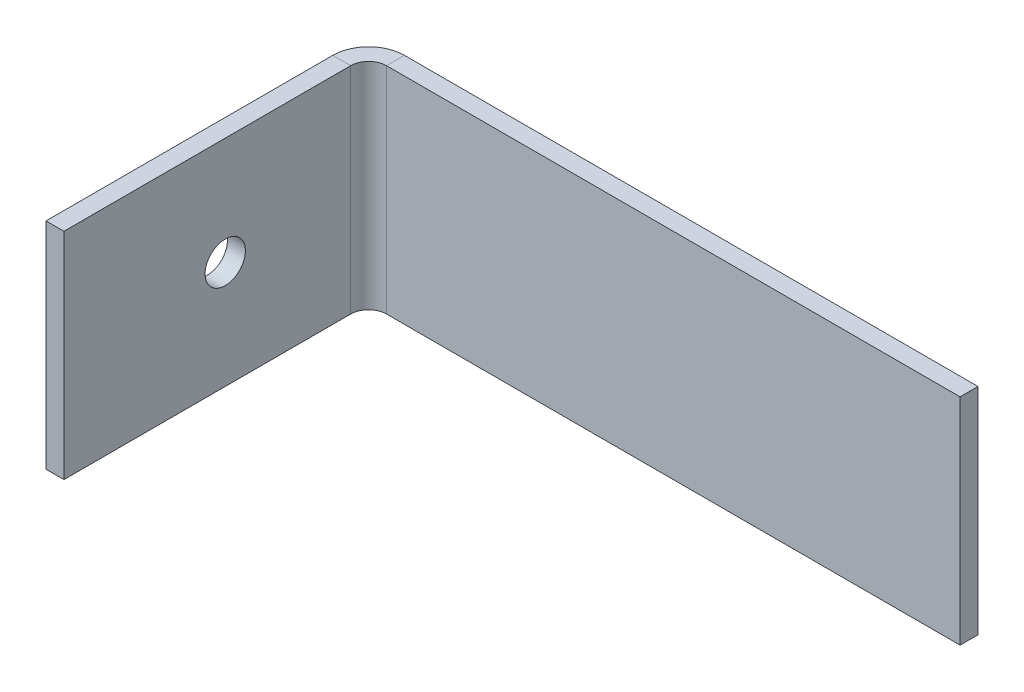
ISO-10303-21;
HEADER;
FILE_DESCRIPTION(('STEP AP214'),'2;1');
FILE_NAME('part.step','',(''),(''),'','','');
FILE_SCHEMA(('AUTOMOTIVE_DESIGN { 1 0 10303 214 1 1 1 1 }'));
ENDSEC;
DATA;
#1=APPLICATION_CONTEXT('core data for automotive mechanical design processes');
#2=APPLICATION_PROTOCOL_DEFINITION('international standard','automotive_design',2000,#1);
#3=PRODUCT_CONTEXT('',#1,'mechanical');
#4=PRODUCT('Part','Part','',(#3));
#5=PRODUCT_RELATED_PRODUCT_CATEGORY('part','',(#4));
#6=PRODUCT_DEFINITION_FORMATION('','',#4);
#7=PRODUCT_DEFINITION_CONTEXT('part definition',#1,'design');
#8=PRODUCT_DEFINITION('design','',#6,#7);
#9=PRODUCT_DEFINITION_SHAPE('','',#8);
#10=(LENGTH_UNIT() NAMED_UNIT(*) SI_UNIT(.MILLI.,.METRE.));
#11=(NAMED_UNIT(*) PLANE_ANGLE_UNIT() SI_UNIT($,.RADIAN.));
#12=(NAMED_UNIT(*) SI_UNIT($,.STERADIAN.) SOLID_ANGLE_UNIT());
#13=UNCERTAINTY_MEASURE_WITH_UNIT(LENGTH_MEASURE(1.E-05),#10,'distance_accuracy_value','');
#14=(GEOMETRIC_REPRESENTATION_CONTEXT(3) GLOBAL_UNCERTAINTY_ASSIGNED_CONTEXT((#13)) GLOBAL_UNIT_ASSIGNED_CONTEXT((#10,
#11,#12)) REPRESENTATION_CONTEXT('',''));
#15=CARTESIAN_POINT('',(0.,0.,0.));
#16=DIRECTION('',(0.,0.,1.));
#17=DIRECTION('',(1.,0.,0.));
#18=AXIS2_PLACEMENT_3D('',#15,#16,#17);
#19=CARTESIAN_POINT('',(107.95,-38.1,-6.35));
#20=DIRECTION('',(0.,-1.,0.));
#21=DIRECTION('',(1.,0.,0.));
#22=AXIS2_PLACEMENT_3D('',#19,#20,#21);
#23=PLANE('',#22);
#24=DIRECTION('',(1.,0.,0.));
#25=VECTOR('',#24,1.);
#26=CARTESIAN_POINT('',(107.95,-38.1,0.));
#27=LINE('',#26,#25);
#28=CARTESIAN_POINT('',(-95.25,-38.1,0.));
#29=VERTEX_POINT('',#28);
#30=CARTESIAN_POINT('',(107.95,-38.1,0.));
#31=VERTEX_POINT('',#30);
#32=EDGE_CURVE('E101',#29,#31,#27,.T.);
#33=ORIENTED_EDGE('',*,*,#32,.F.);
#34=DIRECTION('',(0.,0.,-1.));
#35=VECTOR('',#34,1.);
#36=CARTESIAN_POINT('',(-95.25,-38.1,0.));
#37=LINE('',#36,#35);
#38=CARTESIAN_POINT('',(-95.25,-38.1,-6.34999999999999));
#39=VERTEX_POINT('',#38);
#40=EDGE_CURVE('E116',#29,#39,#37,.T.);
#41=ORIENTED_EDGE('',*,*,#40,.T.);
#42=DIRECTION('',(1.,0.,0.));
#43=VECTOR('',#42,1.);
#44=CARTESIAN_POINT('',(107.95,-38.1,-6.35));
#45=LINE('',#44,#43);
#46=CARTESIAN_POINT('',(107.95,-38.1,-6.35));
#47=VERTEX_POINT('',#46);
#48=EDGE_CURVE('E108',#39,#47,#45,.T.);
#49=ORIENTED_EDGE('',*,*,#48,.T.);
#50=DIRECTION('',(0.,0.,1.));
#51=VECTOR('',#50,1.);
#52=CARTESIAN_POINT('',(107.95,-38.1,-6.35));
#53=LINE('',#52,#51);
#54=EDGE_CURVE('E62',#47,#31,#53,.T.);
#55=ORIENTED_EDGE('',*,*,#54,.T.);
#56=EDGE_LOOP('',(#33,#41,#49,#55));
#57=FACE_BOUND('',#56,.T.);
#58=ADVANCED_FACE('F59',(#57),#23,.T.);
#59=CARTESIAN_POINT('',(0.,0.,-6.35));
#60=DIRECTION('',(0.,0.,1.));
#61=DIRECTION('',(1.,0.,0.));
#62=AXIS2_PLACEMENT_3D('',#59,#60,#61);
#63=PLANE('',#62);
#64=DIRECTION('',(0.,-1.,0.));
#65=VECTOR('',#64,1.);
#66=CARTESIAN_POINT('',(-95.25,-38.1,-6.34999999999999));
#67=LINE('',#66,#65);
#68=CARTESIAN_POINT('',(-95.25,38.1,-6.35));
#69=VERTEX_POINT('',#68);
#70=EDGE_CURVE('E132',#39,#69,#67,.F.);
#71=ORIENTED_EDGE('',*,*,#70,.T.);
#72=DIRECTION('',(-1.,0.,0.));
#73=VECTOR('',#72,1.);
#74=CARTESIAN_POINT('',(107.95,38.1,-6.35));
#75=LINE('',#74,#73);
#76=CARTESIAN_POINT('',(107.95,38.1,-6.35));
#77=VERTEX_POINT('',#76);
#78=EDGE_CURVE('E113',#77,#69,#75,.T.);
#79=ORIENTED_EDGE('',*,*,#78,.F.);
#80=DIRECTION('',(0.,1.,0.));
#81=VECTOR('',#80,1.);
#82=CARTESIAN_POINT('',(107.95,-38.1,-6.35));
#83=LINE('',#82,#81);
#84=EDGE_CURVE('E96',#47,#77,#83,.T.);
#85=ORIENTED_EDGE('',*,*,#84,.F.);
#86=ORIENTED_EDGE('',*,*,#48,.F.);
#87=EDGE_LOOP('',(#71,#79,#85,#86));
#88=FACE_BOUND('',#87,.T.);
#89=ADVANCED_FACE('F227',(#88),#63,.F.);
#90=CARTESIAN_POINT('',(0.,0.,0.));
#91=DIRECTION('',(0.,0.,1.));
#92=DIRECTION('',(1.,0.,0.));
#93=AXIS2_PLACEMENT_3D('',#90,#91,#92);
#94=PLANE('',#93);
#95=DIRECTION('',(-1.,0.,0.));
#96=VECTOR('',#95,1.);
#97=CARTESIAN_POINT('',(107.95,38.1,0.));
#98=LINE('',#97,#96);
#99=CARTESIAN_POINT('',(107.95,38.1,0.));
#100=VERTEX_POINT('',#99);
#101=CARTESIAN_POINT('',(-95.25,38.1,0.));
#102=VERTEX_POINT('',#101);
#103=EDGE_CURVE('E100',#100,#102,#98,.T.);
#104=ORIENTED_EDGE('',*,*,#103,.T.);
#105=DIRECTION('',(0.,-1.,0.));
#106=VECTOR('',#105,1.);
#107=CARTESIAN_POINT('',(-95.25,-38.1,0.));
#108=LINE('',#107,#106);
#109=EDGE_CURVE('E73',#29,#102,#108,.F.);
#110=ORIENTED_EDGE('',*,*,#109,.F.);
#111=ORIENTED_EDGE('',*,*,#32,.T.);
#112=DIRECTION('',(0.,1.,0.));
#113=VECTOR('',#112,1.);
#114=CARTESIAN_POINT('',(107.95,-38.1,0.));
#115=LINE('',#114,#113);
#116=EDGE_CURVE('E94',#31,#100,#115,.T.);
#117=ORIENTED_EDGE('',*,*,#116,.T.);
#118=EDGE_LOOP('',(#104,#110,#111,#117));
#119=FACE_BOUND('',#118,.T.);
#120=ADVANCED_FACE('F98',(#119),#94,.T.);
#121=CARTESIAN_POINT('',(107.95,38.1,-6.35));
#122=DIRECTION('',(0.,1.,0.));
#123=DIRECTION('',(-1.,0.,0.));
#124=AXIS2_PLACEMENT_3D('',#121,#122,#123);
#125=PLANE('',#124);
#126=DIRECTION('',(0.,0.,-1.));
#127=VECTOR('',#126,1.);
#128=CARTESIAN_POINT('',(-95.25,38.1,0.));
#129=LINE('',#128,#127);
#130=EDGE_CURVE('E107',#102,#69,#129,.T.);
#131=ORIENTED_EDGE('',*,*,#130,.F.);
#132=ORIENTED_EDGE('',*,*,#103,.F.);
#133=DIRECTION('',(0.,0.,1.));
#134=VECTOR('',#133,1.);
#135=CARTESIAN_POINT('',(107.95,38.1,-6.35));
#136=LINE('',#135,#134);
#137=EDGE_CURVE('E13',#77,#100,#136,.T.);
#138=ORIENTED_EDGE('',*,*,#137,.F.);
#139=ORIENTED_EDGE('',*,*,#78,.T.);
#140=EDGE_LOOP('',(#131,#132,#138,#139));
#141=FACE_BOUND('',#140,.T.);
#142=ADVANCED_FACE('F105',(#141),#125,.T.);
#143=CARTESIAN_POINT('',(107.95,-38.1,-6.35));
#144=DIRECTION('',(1.,0.,0.));
#145=DIRECTION('',(0.,0.,-1.));
#146=AXIS2_PLACEMENT_3D('',#143,#144,#145);
#147=PLANE('',#146);
#148=ORIENTED_EDGE('',*,*,#116,.F.);
#149=ORIENTED_EDGE('',*,*,#54,.F.);
#150=ORIENTED_EDGE('',*,*,#84,.T.);
#151=ORIENTED_EDGE('',*,*,#137,.T.);
#152=EDGE_LOOP('',(#148,#149,#150,#151));
#153=FACE_BOUND('',#152,.T.);
#154=ADVANCED_FACE('F92',(#153),#147,.T.);
#155=CARTESIAN_POINT('',(-95.25,38.1,6.35));
#156=DIRECTION('',(0.,1.,0.));
#157=DIRECTION('',(0.,0.,1.));
#158=AXIS2_PLACEMENT_3D('',#155,#156,#157);
#159=PLANE('',#158);
#160=DIRECTION('',(1.,0.,0.));
#161=VECTOR('',#160,1.);
#162=CARTESIAN_POINT('',(-107.95,38.1,6.34999999999996));
#163=LINE('',#162,#161);
#164=CARTESIAN_POINT('',(-101.6,38.1,6.34999999999998));
#165=VERTEX_POINT('',#164);
#166=CARTESIAN_POINT('',(-107.95,38.1,6.34999999999996));
#167=VERTEX_POINT('',#166);
#168=EDGE_CURVE('E137',#165,#167,#163,.F.);
#169=ORIENTED_EDGE('',*,*,#168,.F.);
#170=CARTESIAN_POINT('',(-95.25,38.1,6.35));
#171=DIRECTION('',(0.,-1.,0.));
#172=DIRECTION('',(0.,0.,-1.));
#173=AXIS2_PLACEMENT_3D('',#170,#171,#172);
#174=CIRCLE('',#173,6.34999999999999);
#175=EDGE_CURVE('E126',#102,#165,#174,.F.);
#176=ORIENTED_EDGE('',*,*,#175,.F.);
#177=ORIENTED_EDGE('',*,*,#130,.T.);
#178=CARTESIAN_POINT('',(-95.25,38.1,6.35));
#179=DIRECTION('',(0.,-1.,0.));
#180=DIRECTION('',(0.,0.,-1.));
#181=AXIS2_PLACEMENT_3D('',#178,#179,#180);
#182=CIRCLE('',#181,12.7);
#183=EDGE_CURVE('E119',#69,#167,#182,.F.);
#184=ORIENTED_EDGE('',*,*,#183,.T.);
#185=EDGE_LOOP('',(#169,#176,#177,#184));
#186=FACE_BOUND('',#185,.T.);
#187=ADVANCED_FACE('F232',(#186),#159,.T.);
#188=CARTESIAN_POINT('',(-95.25,-38.1,6.35));
#189=DIRECTION('',(0.,1.,0.));
#190=DIRECTION('',(0.,0.,1.));
#191=AXIS2_PLACEMENT_3D('',#188,#189,#190);
#192=PLANE('',#191);
#193=CARTESIAN_POINT('',(-95.25,-38.1,6.35));
#194=DIRECTION('',(0.,-1.,0.));
#195=DIRECTION('',(0.,0.,-1.));
#196=AXIS2_PLACEMENT_3D('',#193,#194,#195);
#197=CIRCLE('',#196,6.34999999999999);
#198=CARTESIAN_POINT('',(-101.6,-38.1,6.34999999999998));
#199=VERTEX_POINT('',#198);
#200=EDGE_CURVE('E121',#199,#29,#197,.T.);
#201=ORIENTED_EDGE('',*,*,#200,.F.);
#202=DIRECTION('',(1.,0.,0.));
#203=VECTOR('',#202,1.);
#204=CARTESIAN_POINT('',(-101.6,-38.1,6.34999999999998));
#205=LINE('',#204,#203);
#206=CARTESIAN_POINT('',(-107.95,-38.1,6.34999999999996));
#207=VERTEX_POINT('',#206);
#208=EDGE_CURVE('E144',#199,#207,#205,.F.);
#209=ORIENTED_EDGE('',*,*,#208,.T.);
#210=CARTESIAN_POINT('',(-95.25,-38.1,6.35));
#211=DIRECTION('',(0.,-1.,0.));
#212=DIRECTION('',(0.,0.,-1.));
#213=AXIS2_PLACEMENT_3D('',#210,#211,#212);
#214=CIRCLE('',#213,12.7);
#215=EDGE_CURVE('E129',#207,#39,#214,.T.);
#216=ORIENTED_EDGE('',*,*,#215,.T.);
#217=ORIENTED_EDGE('',*,*,#40,.F.);
#218=EDGE_LOOP('',(#201,#209,#216,#217));
#219=FACE_BOUND('',#218,.T.);
#220=ADVANCED_FACE('F237',(#219),#192,.F.);
#221=CARTESIAN_POINT('',(-95.25,-38.1,6.35));
#222=DIRECTION('',(0.,-1.,0.));
#223=DIRECTION('',(-1.,0.,0.));
#224=AXIS2_PLACEMENT_3D('',#221,#222,#223);
#225=CYLINDRICAL_SURFACE('',#224,12.7);
#226=ORIENTED_EDGE('',*,*,#70,.F.);
#227=ORIENTED_EDGE('',*,*,#215,.F.);
#228=DIRECTION('',(0.,-1.,0.));
#229=VECTOR('',#228,1.);
#230=CARTESIAN_POINT('',(-107.95,38.1,6.34999999999996));
#231=LINE('',#230,#229);
#232=EDGE_CURVE('E147',#207,#167,#231,.F.);
#233=ORIENTED_EDGE('',*,*,#232,.T.);
#234=ORIENTED_EDGE('',*,*,#183,.F.);
#235=EDGE_LOOP('',(#226,#227,#233,#234));
#236=FACE_BOUND('',#235,.T.);
#237=ADVANCED_FACE('F233',(#236),#225,.T.);
#238=CARTESIAN_POINT('',(-95.25,-38.1,6.35));
#239=DIRECTION('',(0.,-1.,0.));
#240=DIRECTION('',(-1.,0.,0.));
#241=AXIS2_PLACEMENT_3D('',#238,#239,#240);
#242=CYLINDRICAL_SURFACE('',#241,6.34999999999999);
#243=ORIENTED_EDGE('',*,*,#109,.T.);
#244=ORIENTED_EDGE('',*,*,#175,.T.);
#245=DIRECTION('',(0.,-1.,0.));
#246=VECTOR('',#245,1.);
#247=CARTESIAN_POINT('',(-101.6,38.1,6.34999999999998));
#248=LINE('',#247,#246);
#249=EDGE_CURVE('E140',#165,#199,#248,.T.);
#250=ORIENTED_EDGE('',*,*,#249,.T.);
#251=ORIENTED_EDGE('',*,*,#200,.T.);
#252=EDGE_LOOP('',(#243,#244,#250,#251));
#253=FACE_BOUND('',#252,.T.);
#254=ADVANCED_FACE('F239',(#253),#242,.F.);
#255=CARTESIAN_POINT('',(-107.95,38.1,0.));
#256=DIRECTION('',(0.,-1.,0.));
#257=DIRECTION('',(0.,0.,-1.));
#258=AXIS2_PLACEMENT_3D('',#255,#256,#257);
#259=PLANE('',#258);
#260=ORIENTED_EDGE('',*,*,#168,.T.);
#261=DIRECTION('',(0.,0.,-1.));
#262=VECTOR('',#261,1.);
#263=CARTESIAN_POINT('',(-107.95,38.1,-3.96871177312644E-13));
#264=LINE('',#263,#262);
#265=CARTESIAN_POINT('',(-107.95,38.1,107.95));
#266=VERTEX_POINT('',#265);
#267=EDGE_CURVE('E159',#266,#167,#264,.T.);
#268=ORIENTED_EDGE('',*,*,#267,.F.);
#269=DIRECTION('',(1.,0.,0.));
#270=VECTOR('',#269,1.);
#271=CARTESIAN_POINT('',(-107.95,38.1,107.95));
#272=LINE('',#271,#270);
#273=CARTESIAN_POINT('',(-101.6,38.1,107.95));
#274=VERTEX_POINT('',#273);
#275=EDGE_CURVE('E168',#266,#274,#272,.T.);
#276=ORIENTED_EDGE('',*,*,#275,.T.);
#277=DIRECTION('',(0.,0.,1.));
#278=VECTOR('',#277,1.);
#279=CARTESIAN_POINT('',(-101.6,38.1,0.));
#280=LINE('',#279,#278);
#281=EDGE_CURVE('E150',#274,#165,#280,.F.);
#282=ORIENTED_EDGE('',*,*,#281,.T.);
#283=EDGE_LOOP('',(#260,#268,#276,#282));
#284=FACE_BOUND('',#283,.T.);
#285=ADVANCED_FACE('F241',(#284),#259,.F.);
#286=CARTESIAN_POINT('',(-107.95,-38.1,107.95));
#287=DIRECTION('',(0.,1.,0.));
#288=DIRECTION('',(0.,0.,1.));
#289=AXIS2_PLACEMENT_3D('',#286,#287,#288);
#290=PLANE('',#289);
#291=ORIENTED_EDGE('',*,*,#208,.F.);
#292=DIRECTION('',(0.,0.,-1.));
#293=VECTOR('',#292,1.);
#294=CARTESIAN_POINT('',(-101.6,-38.1,107.95));
#295=LINE('',#294,#293);
#296=CARTESIAN_POINT('',(-101.6,-38.1,107.95));
#297=VERTEX_POINT('',#296);
#298=EDGE_CURVE('E153',#199,#297,#295,.F.);
#299=ORIENTED_EDGE('',*,*,#298,.T.);
#300=DIRECTION('',(1.,0.,0.));
#301=VECTOR('',#300,1.);
#302=CARTESIAN_POINT('',(-107.95,-38.1,107.95));
#303=LINE('',#302,#301);
#304=CARTESIAN_POINT('',(-107.95,-38.1,107.95));
#305=VERTEX_POINT('',#304);
#306=EDGE_CURVE('E124',#305,#297,#303,.T.);
#307=ORIENTED_EDGE('',*,*,#306,.F.);
#308=DIRECTION('',(0.,0.,1.));
#309=VECTOR('',#308,1.);
#310=CARTESIAN_POINT('',(-107.95,-38.1,-3.96871177312644E-13));
#311=LINE('',#310,#309);
#312=EDGE_CURVE('E162',#207,#305,#311,.T.);
#313=ORIENTED_EDGE('',*,*,#312,.F.);
#314=EDGE_LOOP('',(#291,#299,#307,#313));
#315=FACE_BOUND('',#314,.T.);
#316=ADVANCED_FACE('F200',(#315),#290,.F.);
#317=CARTESIAN_POINT('',(-107.95,0.,-3.96871177312644E-13));
#318=DIRECTION('',(1.,0.,0.));
#319=DIRECTION('',(0.,0.,-1.));
#320=AXIS2_PLACEMENT_3D('',#317,#318,#319);
#321=PLANE('',#320);
#322=CARTESIAN_POINT('',(-107.95,0.,50.8));
#323=DIRECTION('',(1.,0.,0.));
#324=DIRECTION('',(0.,0.,-1.));
#325=AXIS2_PLACEMENT_3D('',#322,#323,#324);
#326=CIRCLE('',#325,7.14375);
#327=CARTESIAN_POINT('',(-107.95,0.,43.65625));
#328=VERTEX_POINT('',#327);
#329=EDGE_CURVE('E141',#328,#328,#326,.F.);
#330=ORIENTED_EDGE('',*,*,#329,.F.);
#331=EDGE_LOOP('',(#330));
#332=FACE_BOUND('',#331,.T.);
#333=ORIENTED_EDGE('',*,*,#232,.F.);
#334=ORIENTED_EDGE('',*,*,#312,.T.);
#335=DIRECTION('',(0.,1.,0.));
#336=VECTOR('',#335,1.);
#337=CARTESIAN_POINT('',(-107.95,0.,107.95));
#338=LINE('',#337,#336);
#339=EDGE_CURVE('E165',#305,#266,#338,.T.);
#340=ORIENTED_EDGE('',*,*,#339,.T.);
#341=ORIENTED_EDGE('',*,*,#267,.T.);
#342=EDGE_LOOP('',(#333,#334,#340,#341));
#343=FACE_BOUND('',#342,.T.);
#344=ADVANCED_FACE('F186',(#332,#343),#321,.F.);
#345=CARTESIAN_POINT('',(-101.6,0.,-3.7470027081099E-13));
#346=DIRECTION('',(1.,0.,0.));
#347=DIRECTION('',(0.,0.,-1.));
#348=AXIS2_PLACEMENT_3D('',#345,#346,#347);
#349=PLANE('',#348);
#350=CARTESIAN_POINT('',(-101.6,0.,50.8));
#351=DIRECTION('',(1.,0.,0.));
#352=DIRECTION('',(0.,0.,-1.));
#353=AXIS2_PLACEMENT_3D('',#350,#351,#352);
#354=CIRCLE('',#353,7.14375);
#355=CARTESIAN_POINT('',(-101.6,0.,43.65625));
#356=VERTEX_POINT('',#355);
#357=EDGE_CURVE('E175',#356,#356,#354,.T.);
#358=ORIENTED_EDGE('',*,*,#357,.F.);
#359=EDGE_LOOP('',(#358));
#360=FACE_BOUND('',#359,.T.);
#361=ORIENTED_EDGE('',*,*,#298,.F.);
#362=ORIENTED_EDGE('',*,*,#249,.F.);
#363=ORIENTED_EDGE('',*,*,#281,.F.);
#364=DIRECTION('',(0.,-1.,0.));
#365=VECTOR('',#364,1.);
#366=CARTESIAN_POINT('',(-101.6,38.1,107.95));
#367=LINE('',#366,#365);
#368=EDGE_CURVE('E156',#297,#274,#367,.F.);
#369=ORIENTED_EDGE('',*,*,#368,.F.);
#370=EDGE_LOOP('',(#361,#362,#363,#369));
#371=FACE_BOUND('',#370,.T.);
#372=ADVANCED_FACE('F182',(#360,#371),#349,.T.);
#373=CARTESIAN_POINT('',(-107.95,38.1,107.95));
#374=DIRECTION('',(0.,0.,-1.));
#375=DIRECTION('',(-1.,0.,0.));
#376=AXIS2_PLACEMENT_3D('',#373,#374,#375);
#377=PLANE('',#376);
#378=ORIENTED_EDGE('',*,*,#368,.T.);
#379=ORIENTED_EDGE('',*,*,#275,.F.);
#380=ORIENTED_EDGE('',*,*,#339,.F.);
#381=ORIENTED_EDGE('',*,*,#306,.T.);
#382=EDGE_LOOP('',(#378,#379,#380,#381));
#383=FACE_BOUND('',#382,.T.);
#384=ADVANCED_FACE('F185',(#383),#377,.F.);
#385=CARTESIAN_POINT('',(-107.951000000001,0.,50.8));
#386=DIRECTION('',(1.,0.,0.));
#387=DIRECTION('',(0.,0.,-1.));
#388=AXIS2_PLACEMENT_3D('',#385,#386,#387);
#389=CYLINDRICAL_SURFACE('',#388,7.14375);
#390=ORIENTED_EDGE('',*,*,#357,.T.);
#391=EDGE_LOOP('',(#390));
#392=FACE_BOUND('',#391,.T.);
#393=ORIENTED_EDGE('',*,*,#329,.T.);
#394=EDGE_LOOP('',(#393));
#395=FACE_BOUND('',#394,.T.);
#396=ADVANCED_FACE('F179',(#392,#395),#389,.F.);
#397=CLOSED_SHELL('',(#58,#89,#120,#142,#154,#187,#220,#237,#254,#285,#316,#344,#372,#384,#396));
#398=MANIFOLD_SOLID_BREP('B2',#397);
#399=ADVANCED_BREP_SHAPE_REPRESENTATION('',(#18,#398),#14);
#400=SHAPE_DEFINITION_REPRESENTATION(#9,#399);
ENDSEC;
END-ISO-10303-21;
